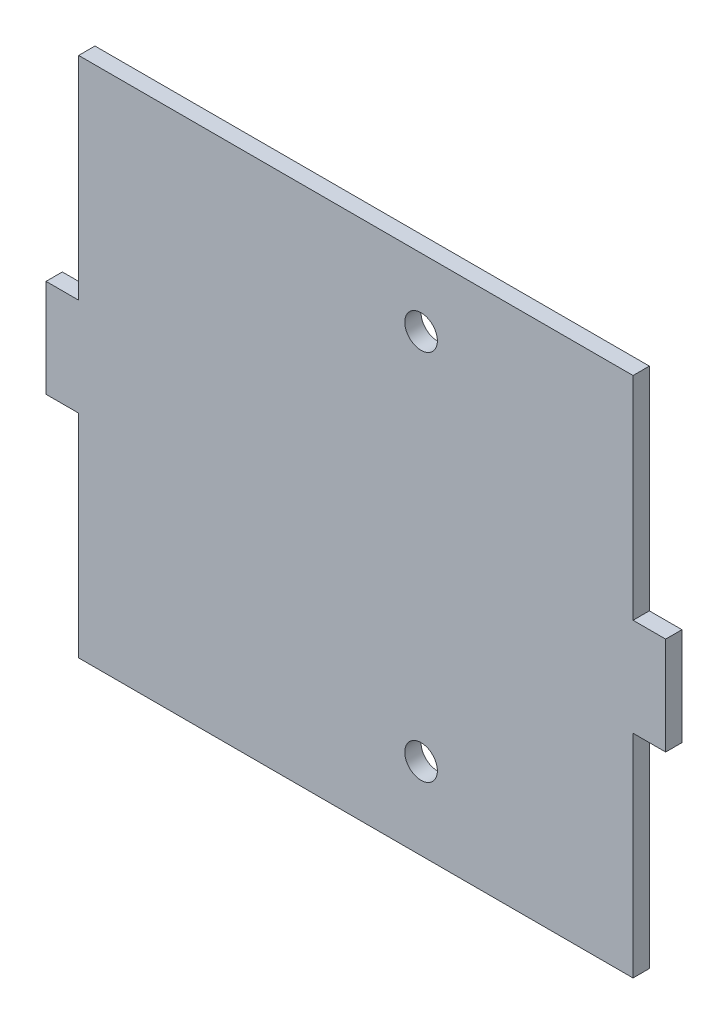
ISO-10303-21;
HEADER;
FILE_DESCRIPTION(('STEP AP214'),'2;1');
FILE_NAME('part.step','',(''),(''),'','','');
FILE_SCHEMA(('AUTOMOTIVE_DESIGN { 1 0 10303 214 1 1 1 1 }'));
ENDSEC;
DATA;
#1=APPLICATION_CONTEXT('core data for automotive mechanical design processes');
#2=APPLICATION_PROTOCOL_DEFINITION('international standard','automotive_design',2000,#1);
#3=PRODUCT_CONTEXT('',#1,'mechanical');
#4=PRODUCT('Part','Part','',(#3));
#5=PRODUCT_RELATED_PRODUCT_CATEGORY('part','',(#4));
#6=PRODUCT_DEFINITION_FORMATION('','',#4);
#7=PRODUCT_DEFINITION_CONTEXT('part definition',#1,'design');
#8=PRODUCT_DEFINITION('design','',#6,#7);
#9=PRODUCT_DEFINITION_SHAPE('','',#8);
#10=(LENGTH_UNIT() NAMED_UNIT(*) SI_UNIT(.MILLI.,.METRE.));
#11=(NAMED_UNIT(*) PLANE_ANGLE_UNIT() SI_UNIT($,.RADIAN.));
#12=(NAMED_UNIT(*) SI_UNIT($,.STERADIAN.) SOLID_ANGLE_UNIT());
#13=UNCERTAINTY_MEASURE_WITH_UNIT(LENGTH_MEASURE(1.E-05),#10,'distance_accuracy_value','');
#14=(GEOMETRIC_REPRESENTATION_CONTEXT(3) GLOBAL_UNCERTAINTY_ASSIGNED_CONTEXT((#13)) GLOBAL_UNIT_ASSIGNED_CONTEXT((#10,
#11,#12)) REPRESENTATION_CONTEXT('',''));
#15=CARTESIAN_POINT('',(0.,0.,0.));
#16=DIRECTION('',(0.,0.,1.));
#17=DIRECTION('',(1.,0.,0.));
#18=AXIS2_PLACEMENT_3D('',#15,#16,#17);
#19=CARTESIAN_POINT('',(215.9,-38.1,6.35));
#20=DIRECTION('',(-1.,0.,0.));
#21=DIRECTION('',(0.,-1.,0.));
#22=AXIS2_PLACEMENT_3D('',#19,#20,#21);
#23=PLANE('',#22);
#24=DIRECTION('',(0.,1.,0.));
#25=VECTOR('',#24,1.);
#26=CARTESIAN_POINT('',(215.9,-38.1,-6.35));
#27=LINE('',#26,#25);
#28=CARTESIAN_POINT('',(215.9,-203.2,-6.35));
#29=VERTEX_POINT('',#28);
#30=CARTESIAN_POINT('',(215.9,-38.1,-6.35));
#31=VERTEX_POINT('',#30);
#32=EDGE_CURVE('E198',#29,#31,#27,.T.);
#33=ORIENTED_EDGE('',*,*,#32,.T.);
#34=DIRECTION('',(0.,0.,-1.));
#35=VECTOR('',#34,1.);
#36=CARTESIAN_POINT('',(215.9,-38.1,6.35));
#37=LINE('',#36,#35);
#38=CARTESIAN_POINT('',(215.9,-38.1,6.35));
#39=VERTEX_POINT('',#38);
#40=EDGE_CURVE('E176',#39,#31,#37,.T.);
#41=ORIENTED_EDGE('',*,*,#40,.F.);
#42=DIRECTION('',(0.,1.,0.));
#43=VECTOR('',#42,1.);
#44=CARTESIAN_POINT('',(215.9,-38.1,6.35));
#45=LINE('',#44,#43);
#46=CARTESIAN_POINT('',(215.9,-203.2,6.35));
#47=VERTEX_POINT('',#46);
#48=EDGE_CURVE('E231',#47,#39,#45,.T.);
#49=ORIENTED_EDGE('',*,*,#48,.F.);
#50=DIRECTION('',(0.,0.,-1.));
#51=VECTOR('',#50,1.);
#52=CARTESIAN_POINT('',(215.9,-203.2,6.35));
#53=LINE('',#52,#51);
#54=EDGE_CURVE('E179',#47,#29,#53,.T.);
#55=ORIENTED_EDGE('',*,*,#54,.T.);
#56=EDGE_LOOP('',(#33,#41,#49,#55));
#57=FACE_BOUND('',#56,.T.);
#58=ADVANCED_FACE('F46',(#57),#23,.F.);
#59=CARTESIAN_POINT('',(215.9,-38.1,6.35));
#60=DIRECTION('',(0.,1.,0.));
#61=DIRECTION('',(-1.,0.,0.));
#62=AXIS2_PLACEMENT_3D('',#59,#60,#61);
#63=PLANE('',#62);
#64=DIRECTION('',(1.,0.,0.));
#65=VECTOR('',#64,1.);
#66=CARTESIAN_POINT('',(215.9,-38.1,-6.35));
#67=LINE('',#66,#65);
#68=CARTESIAN_POINT('',(241.3,-38.1,-6.35));
#69=VERTEX_POINT('',#68);
#70=EDGE_CURVE('E69',#31,#69,#67,.T.);
#71=ORIENTED_EDGE('',*,*,#70,.T.);
#72=DIRECTION('',(0.,0.,-1.));
#73=VECTOR('',#72,1.);
#74=CARTESIAN_POINT('',(241.3,-38.1,6.35));
#75=LINE('',#74,#73);
#76=CARTESIAN_POINT('',(241.3,-38.1,6.35));
#77=VERTEX_POINT('',#76);
#78=EDGE_CURVE('E173',#77,#69,#75,.T.);
#79=ORIENTED_EDGE('',*,*,#78,.F.);
#80=DIRECTION('',(1.,0.,0.));
#81=VECTOR('',#80,1.);
#82=CARTESIAN_POINT('',(215.9,-38.1,6.35));
#83=LINE('',#82,#81);
#84=EDGE_CURVE('E121',#39,#77,#83,.T.);
#85=ORIENTED_EDGE('',*,*,#84,.F.);
#86=ORIENTED_EDGE('',*,*,#40,.T.);
#87=EDGE_LOOP('',(#71,#79,#85,#86));
#88=FACE_BOUND('',#87,.T.);
#89=ADVANCED_FACE('F172',(#88),#63,.F.);
#90=CARTESIAN_POINT('',(241.3,38.1,6.35));
#91=DIRECTION('',(-1.,0.,0.));
#92=DIRECTION('',(0.,0.,1.));
#93=AXIS2_PLACEMENT_3D('',#90,#91,#92);
#94=PLANE('',#93);
#95=DIRECTION('',(0.,1.,0.));
#96=VECTOR('',#95,1.);
#97=CARTESIAN_POINT('',(241.3,38.1,-6.35));
#98=LINE('',#97,#96);
#99=CARTESIAN_POINT('',(241.3,38.1,-6.35));
#100=VERTEX_POINT('',#99);
#101=EDGE_CURVE('E169',#69,#100,#98,.T.);
#102=ORIENTED_EDGE('',*,*,#101,.T.);
#103=DIRECTION('',(0.,0.,-1.));
#104=VECTOR('',#103,1.);
#105=CARTESIAN_POINT('',(241.3,38.1,6.35));
#106=LINE('',#105,#104);
#107=CARTESIAN_POINT('',(241.3,38.1,6.35));
#108=VERTEX_POINT('',#107);
#109=EDGE_CURVE('E278',#108,#100,#106,.T.);
#110=ORIENTED_EDGE('',*,*,#109,.F.);
#111=DIRECTION('',(0.,1.,0.));
#112=VECTOR('',#111,1.);
#113=CARTESIAN_POINT('',(241.3,38.1,6.35));
#114=LINE('',#113,#112);
#115=EDGE_CURVE('E182',#77,#108,#114,.T.);
#116=ORIENTED_EDGE('',*,*,#115,.F.);
#117=ORIENTED_EDGE('',*,*,#78,.T.);
#118=EDGE_LOOP('',(#102,#110,#116,#117));
#119=FACE_BOUND('',#118,.T.);
#120=ADVANCED_FACE('F181',(#119),#94,.F.);
#121=CARTESIAN_POINT('',(215.9,38.1,6.35));
#122=DIRECTION('',(0.,-1.,0.));
#123=DIRECTION('',(0.,0.,-1.));
#124=AXIS2_PLACEMENT_3D('',#121,#122,#123);
#125=PLANE('',#124);
#126=DIRECTION('',(-1.,0.,0.));
#127=VECTOR('',#126,1.);
#128=CARTESIAN_POINT('',(215.9,38.1,-6.35));
#129=LINE('',#128,#127);
#130=CARTESIAN_POINT('',(215.9,38.1,-6.35));
#131=VERTEX_POINT('',#130);
#132=EDGE_CURVE('E184',#100,#131,#129,.T.);
#133=ORIENTED_EDGE('',*,*,#132,.T.);
#134=DIRECTION('',(0.,0.,-1.));
#135=VECTOR('',#134,1.);
#136=CARTESIAN_POINT('',(215.9,38.1,6.35));
#137=LINE('',#136,#135);
#138=CARTESIAN_POINT('',(215.9,38.1,6.35));
#139=VERTEX_POINT('',#138);
#140=EDGE_CURVE('E275',#139,#131,#137,.T.);
#141=ORIENTED_EDGE('',*,*,#140,.F.);
#142=DIRECTION('',(-1.,0.,0.));
#143=VECTOR('',#142,1.);
#144=CARTESIAN_POINT('',(215.9,38.1,6.35));
#145=LINE('',#144,#143);
#146=EDGE_CURVE('E225',#108,#139,#145,.T.);
#147=ORIENTED_EDGE('',*,*,#146,.F.);
#148=ORIENTED_EDGE('',*,*,#109,.T.);
#149=EDGE_LOOP('',(#133,#141,#147,#148));
#150=FACE_BOUND('',#149,.T.);
#151=ADVANCED_FACE('F336',(#150),#125,.F.);
#152=CARTESIAN_POINT('',(215.9,203.2,6.35));
#153=DIRECTION('',(-1.,0.,0.));
#154=DIRECTION('',(0.,-1.,0.));
#155=AXIS2_PLACEMENT_3D('',#152,#153,#154);
#156=PLANE('',#155);
#157=DIRECTION('',(0.,1.,0.));
#158=VECTOR('',#157,1.);
#159=CARTESIAN_POINT('',(215.9,203.2,-6.35));
#160=LINE('',#159,#158);
#161=CARTESIAN_POINT('',(215.9,203.2,-6.35));
#162=VERTEX_POINT('',#161);
#163=EDGE_CURVE('E276',#131,#162,#160,.T.);
#164=ORIENTED_EDGE('',*,*,#163,.T.);
#165=DIRECTION('',(0.,0.,-1.));
#166=VECTOR('',#165,1.);
#167=CARTESIAN_POINT('',(215.9,203.2,6.35));
#168=LINE('',#167,#166);
#169=CARTESIAN_POINT('',(215.9,203.2,6.35));
#170=VERTEX_POINT('',#169);
#171=EDGE_CURVE('E273',#170,#162,#168,.T.);
#172=ORIENTED_EDGE('',*,*,#171,.F.);
#173=DIRECTION('',(0.,1.,0.));
#174=VECTOR('',#173,1.);
#175=CARTESIAN_POINT('',(215.9,203.2,6.35));
#176=LINE('',#175,#174);
#177=EDGE_CURVE('E222',#139,#170,#176,.T.);
#178=ORIENTED_EDGE('',*,*,#177,.F.);
#179=ORIENTED_EDGE('',*,*,#140,.T.);
#180=EDGE_LOOP('',(#164,#172,#178,#179));
#181=FACE_BOUND('',#180,.T.);
#182=ADVANCED_FACE('F334',(#181),#156,.F.);
#183=CARTESIAN_POINT('',(-215.9,203.2,6.35));
#184=DIRECTION('',(0.,-1.,0.));
#185=DIRECTION('',(0.,0.,-1.));
#186=AXIS2_PLACEMENT_3D('',#183,#184,#185);
#187=PLANE('',#186);
#188=DIRECTION('',(-1.,0.,0.));
#189=VECTOR('',#188,1.);
#190=CARTESIAN_POINT('',(-215.9,203.2,-6.35));
#191=LINE('',#190,#189);
#192=CARTESIAN_POINT('',(-215.9,203.2,-6.35));
#193=VERTEX_POINT('',#192);
#194=EDGE_CURVE('E274',#162,#193,#191,.T.);
#195=ORIENTED_EDGE('',*,*,#194,.T.);
#196=DIRECTION('',(0.,0.,-1.));
#197=VECTOR('',#196,1.);
#198=CARTESIAN_POINT('',(-215.9,203.2,6.35));
#199=LINE('',#198,#197);
#200=CARTESIAN_POINT('',(-215.9,203.2,6.35));
#201=VERTEX_POINT('',#200);
#202=EDGE_CURVE('E269',#201,#193,#199,.T.);
#203=ORIENTED_EDGE('',*,*,#202,.F.);
#204=DIRECTION('',(-1.,0.,0.));
#205=VECTOR('',#204,1.);
#206=CARTESIAN_POINT('',(-215.9,203.2,6.35));
#207=LINE('',#206,#205);
#208=EDGE_CURVE('E219',#170,#201,#207,.T.);
#209=ORIENTED_EDGE('',*,*,#208,.F.);
#210=ORIENTED_EDGE('',*,*,#171,.T.);
#211=EDGE_LOOP('',(#195,#203,#209,#210));
#212=FACE_BOUND('',#211,.T.);
#213=ADVANCED_FACE('F332',(#212),#187,.F.);
#214=CARTESIAN_POINT('',(-215.9,203.2,6.35));
#215=DIRECTION('',(1.,0.,0.));
#216=DIRECTION('',(0.,0.,-1.));
#217=AXIS2_PLACEMENT_3D('',#214,#215,#216);
#218=PLANE('',#217);
#219=DIRECTION('',(0.,-1.,0.));
#220=VECTOR('',#219,1.);
#221=CARTESIAN_POINT('',(-215.9,203.2,-6.35));
#222=LINE('',#221,#220);
#223=CARTESIAN_POINT('',(-215.9,38.1,-6.35));
#224=VERTEX_POINT('',#223);
#225=EDGE_CURVE('E270',#193,#224,#222,.T.);
#226=ORIENTED_EDGE('',*,*,#225,.T.);
#227=DIRECTION('',(0.,0.,-1.));
#228=VECTOR('',#227,1.);
#229=CARTESIAN_POINT('',(-215.9,38.1,6.35));
#230=LINE('',#229,#228);
#231=CARTESIAN_POINT('',(-215.9,38.1,6.35));
#232=VERTEX_POINT('',#231);
#233=EDGE_CURVE('E265',#232,#224,#230,.T.);
#234=ORIENTED_EDGE('',*,*,#233,.F.);
#235=DIRECTION('',(0.,-1.,0.));
#236=VECTOR('',#235,1.);
#237=CARTESIAN_POINT('',(-215.9,203.2,6.35));
#238=LINE('',#237,#236);
#239=EDGE_CURVE('E216',#201,#232,#238,.T.);
#240=ORIENTED_EDGE('',*,*,#239,.F.);
#241=ORIENTED_EDGE('',*,*,#202,.T.);
#242=EDGE_LOOP('',(#226,#234,#240,#241));
#243=FACE_BOUND('',#242,.T.);
#244=ADVANCED_FACE('F327',(#243),#218,.F.);
#245=CARTESIAN_POINT('',(-215.9,38.1,6.35));
#246=DIRECTION('',(0.,-1.,0.));
#247=DIRECTION('',(1.,0.,0.));
#248=AXIS2_PLACEMENT_3D('',#245,#246,#247);
#249=PLANE('',#248);
#250=DIRECTION('',(-1.,0.,0.));
#251=VECTOR('',#250,1.);
#252=CARTESIAN_POINT('',(-215.9,38.1,-6.35));
#253=LINE('',#252,#251);
#254=CARTESIAN_POINT('',(-241.3,38.1,-6.35));
#255=VERTEX_POINT('',#254);
#256=EDGE_CURVE('E266',#224,#255,#253,.T.);
#257=ORIENTED_EDGE('',*,*,#256,.T.);
#258=DIRECTION('',(0.,0.,-1.));
#259=VECTOR('',#258,1.);
#260=CARTESIAN_POINT('',(-241.3,38.1,6.35));
#261=LINE('',#260,#259);
#262=CARTESIAN_POINT('',(-241.3,38.1,6.35));
#263=VERTEX_POINT('',#262);
#264=EDGE_CURVE('E261',#263,#255,#261,.T.);
#265=ORIENTED_EDGE('',*,*,#264,.F.);
#266=DIRECTION('',(-1.,0.,0.));
#267=VECTOR('',#266,1.);
#268=CARTESIAN_POINT('',(-215.9,38.1,6.35));
#269=LINE('',#268,#267);
#270=EDGE_CURVE('E213',#232,#263,#269,.T.);
#271=ORIENTED_EDGE('',*,*,#270,.F.);
#272=ORIENTED_EDGE('',*,*,#233,.T.);
#273=EDGE_LOOP('',(#257,#265,#271,#272));
#274=FACE_BOUND('',#273,.T.);
#275=ADVANCED_FACE('F322',(#274),#249,.F.);
#276=CARTESIAN_POINT('',(-241.3,38.1,6.35));
#277=DIRECTION('',(1.,0.,0.));
#278=DIRECTION('',(0.,0.,-1.));
#279=AXIS2_PLACEMENT_3D('',#276,#277,#278);
#280=PLANE('',#279);
#281=DIRECTION('',(0.,-1.,0.));
#282=VECTOR('',#281,1.);
#283=CARTESIAN_POINT('',(-241.3,38.1,-6.35));
#284=LINE('',#283,#282);
#285=CARTESIAN_POINT('',(-241.3,-38.1,-6.35));
#286=VERTEX_POINT('',#285);
#287=EDGE_CURVE('E262',#255,#286,#284,.T.);
#288=ORIENTED_EDGE('',*,*,#287,.T.);
#289=DIRECTION('',(0.,0.,-1.));
#290=VECTOR('',#289,1.);
#291=CARTESIAN_POINT('',(-241.3,-38.1,6.35));
#292=LINE('',#291,#290);
#293=CARTESIAN_POINT('',(-241.3,-38.1,6.35));
#294=VERTEX_POINT('',#293);
#295=EDGE_CURVE('E257',#294,#286,#292,.T.);
#296=ORIENTED_EDGE('',*,*,#295,.F.);
#297=DIRECTION('',(0.,-1.,0.));
#298=VECTOR('',#297,1.);
#299=CARTESIAN_POINT('',(-241.3,38.1,6.35));
#300=LINE('',#299,#298);
#301=EDGE_CURVE('E210',#263,#294,#300,.T.);
#302=ORIENTED_EDGE('',*,*,#301,.F.);
#303=ORIENTED_EDGE('',*,*,#264,.T.);
#304=EDGE_LOOP('',(#288,#296,#302,#303));
#305=FACE_BOUND('',#304,.T.);
#306=ADVANCED_FACE('F320',(#305),#280,.F.);
#307=CARTESIAN_POINT('',(-215.9,-38.1,6.35));
#308=DIRECTION('',(0.,1.,0.));
#309=DIRECTION('',(-1.,0.,0.));
#310=AXIS2_PLACEMENT_3D('',#307,#308,#309);
#311=PLANE('',#310);
#312=DIRECTION('',(1.,0.,0.));
#313=VECTOR('',#312,1.);
#314=CARTESIAN_POINT('',(-215.9,-38.1,-6.35));
#315=LINE('',#314,#313);
#316=CARTESIAN_POINT('',(-215.9,-38.1,-6.35));
#317=VERTEX_POINT('',#316);
#318=EDGE_CURVE('E258',#286,#317,#315,.T.);
#319=ORIENTED_EDGE('',*,*,#318,.T.);
#320=DIRECTION('',(0.,0.,-1.));
#321=VECTOR('',#320,1.);
#322=CARTESIAN_POINT('',(-215.9,-38.1,6.35));
#323=LINE('',#322,#321);
#324=CARTESIAN_POINT('',(-215.9,-38.1,6.35));
#325=VERTEX_POINT('',#324);
#326=EDGE_CURVE('E248',#325,#317,#323,.T.);
#327=ORIENTED_EDGE('',*,*,#326,.F.);
#328=DIRECTION('',(1.,0.,0.));
#329=VECTOR('',#328,1.);
#330=CARTESIAN_POINT('',(-215.9,-38.1,6.35));
#331=LINE('',#330,#329);
#332=EDGE_CURVE('E207',#294,#325,#331,.T.);
#333=ORIENTED_EDGE('',*,*,#332,.F.);
#334=ORIENTED_EDGE('',*,*,#295,.T.);
#335=EDGE_LOOP('',(#319,#327,#333,#334));
#336=FACE_BOUND('',#335,.T.);
#337=ADVANCED_FACE('F306',(#336),#311,.F.);
#338=CARTESIAN_POINT('',(-215.9,-38.1,6.35));
#339=DIRECTION('',(1.,0.,0.));
#340=DIRECTION('',(0.,1.,0.));
#341=AXIS2_PLACEMENT_3D('',#338,#339,#340);
#342=PLANE('',#341);
#343=DIRECTION('',(0.,-1.,0.));
#344=VECTOR('',#343,1.);
#345=CARTESIAN_POINT('',(-215.9,-38.1,-6.35));
#346=LINE('',#345,#344);
#347=CARTESIAN_POINT('',(-215.9,-203.2,-6.35));
#348=VERTEX_POINT('',#347);
#349=EDGE_CURVE('E255',#317,#348,#346,.T.);
#350=ORIENTED_EDGE('',*,*,#349,.T.);
#351=DIRECTION('',(0.,0.,-1.));
#352=VECTOR('',#351,1.);
#353=CARTESIAN_POINT('',(-215.9,-203.2,6.35));
#354=LINE('',#353,#352);
#355=CARTESIAN_POINT('',(-215.9,-203.2,6.35));
#356=VERTEX_POINT('',#355);
#357=EDGE_CURVE('E236',#356,#348,#354,.T.);
#358=ORIENTED_EDGE('',*,*,#357,.F.);
#359=DIRECTION('',(0.,-1.,0.));
#360=VECTOR('',#359,1.);
#361=CARTESIAN_POINT('',(-215.9,-38.1,6.35));
#362=LINE('',#361,#360);
#363=EDGE_CURVE('E204',#325,#356,#362,.T.);
#364=ORIENTED_EDGE('',*,*,#363,.F.);
#365=ORIENTED_EDGE('',*,*,#326,.T.);
#366=EDGE_LOOP('',(#350,#358,#364,#365));
#367=FACE_BOUND('',#366,.T.);
#368=ADVANCED_FACE('F315',(#367),#342,.F.);
#369=CARTESIAN_POINT('',(-215.9,-203.2,6.35));
#370=DIRECTION('',(0.,1.,0.));
#371=DIRECTION('',(0.,0.,1.));
#372=AXIS2_PLACEMENT_3D('',#369,#370,#371);
#373=PLANE('',#372);
#374=DIRECTION('',(1.,0.,0.));
#375=VECTOR('',#374,1.);
#376=CARTESIAN_POINT('',(-215.9,-203.2,-6.35));
#377=LINE('',#376,#375);
#378=EDGE_CURVE('E130',#348,#29,#377,.T.);
#379=ORIENTED_EDGE('',*,*,#378,.T.);
#380=ORIENTED_EDGE('',*,*,#54,.F.);
#381=DIRECTION('',(1.,0.,0.));
#382=VECTOR('',#381,1.);
#383=CARTESIAN_POINT('',(-215.9,-203.2,6.35));
#384=LINE('',#383,#382);
#385=EDGE_CURVE('E201',#356,#47,#384,.T.);
#386=ORIENTED_EDGE('',*,*,#385,.F.);
#387=ORIENTED_EDGE('',*,*,#357,.T.);
#388=EDGE_LOOP('',(#379,#380,#386,#387));
#389=FACE_BOUND('',#388,.T.);
#390=ADVANCED_FACE('F353',(#389),#373,.F.);
#391=CARTESIAN_POINT('',(0.,0.,6.35));
#392=DIRECTION('',(0.,0.,1.));
#393=DIRECTION('',(1.,0.,0.));
#394=AXIS2_PLACEMENT_3D('',#391,#392,#393);
#395=PLANE('',#394);
#396=CARTESIAN_POINT('',(50.8000000000004,150.299999999983,6.34999999999999));
#397=DIRECTION('',(0.,0.,1.));
#398=DIRECTION('',(1.,0.,0.));
#399=AXIS2_PLACEMENT_3D('',#396,#397,#398);
#400=CIRCLE('',#399,12.7000000000001);
#401=CARTESIAN_POINT('',(63.5000000000005,150.299999999983,6.34999999999999));
#402=VERTEX_POINT('',#401);
#403=EDGE_CURVE('E233',#402,#402,#400,.F.);
#404=ORIENTED_EDGE('',*,*,#403,.T.);
#405=EDGE_LOOP('',(#404));
#406=FACE_BOUND('',#405,.T.);
#407=CARTESIAN_POINT('',(50.8000000000004,-139.700000000005,6.34999999999999));
#408=DIRECTION('',(0.,0.,1.));
#409=DIRECTION('',(1.,0.,0.));
#410=AXIS2_PLACEMENT_3D('',#407,#408,#409);
#411=CIRCLE('',#410,12.7000000000001);
#412=CARTESIAN_POINT('',(63.5000000000005,-139.700000000005,6.34999999999999));
#413=VERTEX_POINT('',#412);
#414=EDGE_CURVE('E50',#413,#413,#411,.F.);
#415=ORIENTED_EDGE('',*,*,#414,.T.);
#416=EDGE_LOOP('',(#415));
#417=FACE_BOUND('',#416,.T.);
#418=ORIENTED_EDGE('',*,*,#48,.T.);
#419=ORIENTED_EDGE('',*,*,#84,.T.);
#420=ORIENTED_EDGE('',*,*,#115,.T.);
#421=ORIENTED_EDGE('',*,*,#146,.T.);
#422=ORIENTED_EDGE('',*,*,#177,.T.);
#423=ORIENTED_EDGE('',*,*,#208,.T.);
#424=ORIENTED_EDGE('',*,*,#239,.T.);
#425=ORIENTED_EDGE('',*,*,#270,.T.);
#426=ORIENTED_EDGE('',*,*,#301,.T.);
#427=ORIENTED_EDGE('',*,*,#332,.T.);
#428=ORIENTED_EDGE('',*,*,#363,.T.);
#429=ORIENTED_EDGE('',*,*,#385,.T.);
#430=EDGE_LOOP('',(#418,#419,#420,#421,#422,#423,#424,#425,#426,#427,#428,#429));
#431=FACE_BOUND('',#430,.T.);
#432=ADVANCED_FACE('F48',(#406,#417,#431),#395,.T.);
#433=CARTESIAN_POINT('',(0.,0.,-6.35));
#434=DIRECTION('',(0.,0.,1.));
#435=DIRECTION('',(1.,0.,0.));
#436=AXIS2_PLACEMENT_3D('',#433,#434,#435);
#437=PLANE('',#436);
#438=CARTESIAN_POINT('',(50.8000000000004,150.299999999983,-6.35000000000002));
#439=DIRECTION('',(0.,0.,1.));
#440=DIRECTION('',(1.,0.,0.));
#441=AXIS2_PLACEMENT_3D('',#438,#439,#440);
#442=CIRCLE('',#441,12.7000000000001);
#443=CARTESIAN_POINT('',(63.5000000000005,150.299999999983,-6.35000000000002));
#444=VERTEX_POINT('',#443);
#445=EDGE_CURVE('E11',#444,#444,#442,.F.);
#446=ORIENTED_EDGE('',*,*,#445,.F.);
#447=EDGE_LOOP('',(#446));
#448=FACE_BOUND('',#447,.T.);
#449=CARTESIAN_POINT('',(50.8000000000004,-139.700000000005,-6.34999999999999));
#450=DIRECTION('',(0.,0.,1.));
#451=DIRECTION('',(1.,0.,0.));
#452=AXIS2_PLACEMENT_3D('',#449,#450,#451);
#453=CIRCLE('',#452,12.7000000000001);
#454=CARTESIAN_POINT('',(63.5000000000005,-139.700000000005,-6.34999999999999));
#455=VERTEX_POINT('',#454);
#456=EDGE_CURVE('E57',#455,#455,#453,.F.);
#457=ORIENTED_EDGE('',*,*,#456,.F.);
#458=EDGE_LOOP('',(#457));
#459=FACE_BOUND('',#458,.T.);
#460=ORIENTED_EDGE('',*,*,#32,.F.);
#461=ORIENTED_EDGE('',*,*,#378,.F.);
#462=ORIENTED_EDGE('',*,*,#349,.F.);
#463=ORIENTED_EDGE('',*,*,#318,.F.);
#464=ORIENTED_EDGE('',*,*,#287,.F.);
#465=ORIENTED_EDGE('',*,*,#256,.F.);
#466=ORIENTED_EDGE('',*,*,#225,.F.);
#467=ORIENTED_EDGE('',*,*,#194,.F.);
#468=ORIENTED_EDGE('',*,*,#163,.F.);
#469=ORIENTED_EDGE('',*,*,#132,.F.);
#470=ORIENTED_EDGE('',*,*,#101,.F.);
#471=ORIENTED_EDGE('',*,*,#70,.F.);
#472=EDGE_LOOP('',(#460,#461,#462,#463,#464,#465,#466,#467,#468,#469,#470,#471));
#473=FACE_BOUND('',#472,.T.);
#474=ADVANCED_FACE('F187',(#448,#459,#473),#437,.F.);
#475=CARTESIAN_POINT('',(50.8000000000004,-139.700000000005,173.4));
#476=DIRECTION('',(0.,0.,-1.));
#477=DIRECTION('',(-1.,0.,0.));
#478=AXIS2_PLACEMENT_3D('',#475,#476,#477);
#479=CYLINDRICAL_SURFACE('',#478,12.7000000000001);
#480=ORIENTED_EDGE('',*,*,#414,.F.);
#481=EDGE_LOOP('',(#480));
#482=FACE_BOUND('',#481,.T.);
#483=ORIENTED_EDGE('',*,*,#456,.T.);
#484=EDGE_LOOP('',(#483));
#485=FACE_BOUND('',#484,.T.);
#486=ADVANCED_FACE('F363',(#482,#485),#479,.F.);
#487=CARTESIAN_POINT('',(50.8000000000004,150.299999999983,248.4));
#488=DIRECTION('',(0.,0.,-1.));
#489=DIRECTION('',(-1.,0.,0.));
#490=AXIS2_PLACEMENT_3D('',#487,#488,#489);
#491=CYLINDRICAL_SURFACE('',#490,12.7000000000001);
#492=ORIENTED_EDGE('',*,*,#403,.F.);
#493=EDGE_LOOP('',(#492));
#494=FACE_BOUND('',#493,.T.);
#495=ORIENTED_EDGE('',*,*,#445,.T.);
#496=EDGE_LOOP('',(#495));
#497=FACE_BOUND('',#496,.T.);
#498=ADVANCED_FACE('F366',(#494,#497),#491,.F.);
#499=CLOSED_SHELL('',(#58,#89,#120,#151,#182,#213,#244,#275,#306,#337,#368,#390,#432,#474,#486,#498));
#500=MANIFOLD_SOLID_BREP('B2',#499);
#501=ADVANCED_BREP_SHAPE_REPRESENTATION('',(#18,#500),#14);
#502=SHAPE_DEFINITION_REPRESENTATION(#9,#501);
ENDSEC;
END-ISO-10303-21;
